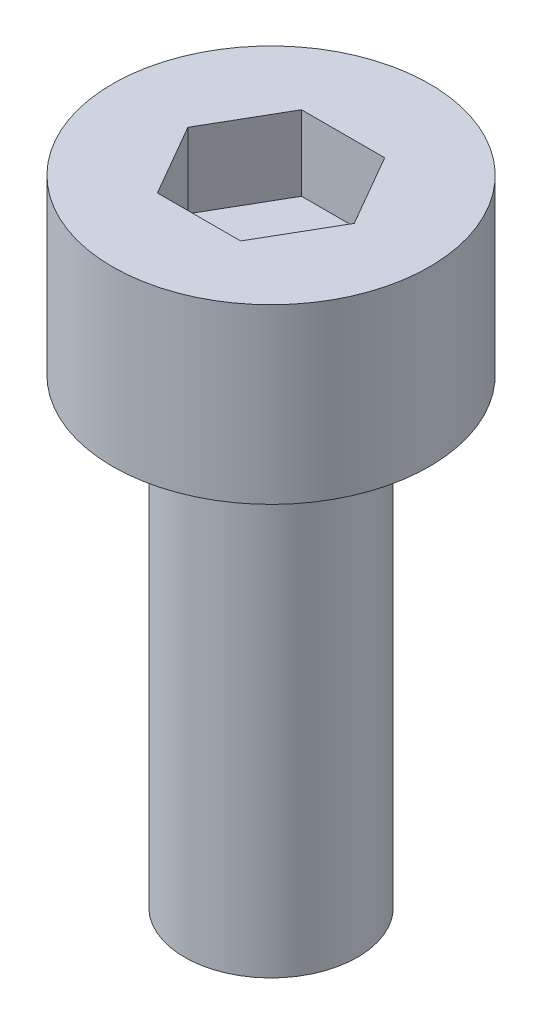
ISO-10303-21;
HEADER;
FILE_DESCRIPTION(('STEP AP214'),'2;1');
FILE_NAME('part.step','',(''),(''),'','','');
FILE_SCHEMA(('AUTOMOTIVE_DESIGN { 1 0 10303 214 1 1 1 1 }'));
ENDSEC;
DATA;
#1=APPLICATION_CONTEXT('core data for automotive mechanical design processes');
#2=APPLICATION_PROTOCOL_DEFINITION('international standard','automotive_design',2000,#1);
#3=PRODUCT_CONTEXT('',#1,'mechanical');
#4=PRODUCT('Part','Part','',(#3));
#5=PRODUCT_RELATED_PRODUCT_CATEGORY('part','',(#4));
#6=PRODUCT_DEFINITION_FORMATION('','',#4);
#7=PRODUCT_DEFINITION_CONTEXT('part definition',#1,'design');
#8=PRODUCT_DEFINITION('design','',#6,#7);
#9=PRODUCT_DEFINITION_SHAPE('','',#8);
#10=(LENGTH_UNIT() NAMED_UNIT(*) SI_UNIT(.MILLI.,.METRE.));
#11=(NAMED_UNIT(*) PLANE_ANGLE_UNIT() SI_UNIT($,.RADIAN.));
#12=(NAMED_UNIT(*) SI_UNIT($,.STERADIAN.) SOLID_ANGLE_UNIT());
#13=UNCERTAINTY_MEASURE_WITH_UNIT(LENGTH_MEASURE(1.E-05),#10,'distance_accuracy_value','');
#14=(GEOMETRIC_REPRESENTATION_CONTEXT(3) GLOBAL_UNCERTAINTY_ASSIGNED_CONTEXT((#13)) GLOBAL_UNIT_ASSIGNED_CONTEXT((#10,
#11,#12)) REPRESENTATION_CONTEXT('',''));
#15=CARTESIAN_POINT('',(0.,0.,0.));
#16=DIRECTION('',(0.,0.,1.));
#17=DIRECTION('',(1.,0.,0.));
#18=AXIS2_PLACEMENT_3D('',#15,#16,#17);
#19=CARTESIAN_POINT('',(0.,3.,0.));
#20=DIRECTION('',(0.,-1.,0.));
#21=DIRECTION('',(0.,0.,-1.));
#22=AXIS2_PLACEMENT_3D('',#19,#20,#21);
#23=CYLINDRICAL_SURFACE('',#22,2.75);
#24=CARTESIAN_POINT('',(0.,3.,0.));
#25=DIRECTION('',(0.,1.,0.));
#26=DIRECTION('',(0.,0.,1.));
#27=AXIS2_PLACEMENT_3D('',#24,#25,#26);
#28=CIRCLE('',#27,2.75);
#29=CARTESIAN_POINT('',(0.,3.,2.75));
#30=VERTEX_POINT('',#29);
#31=EDGE_CURVE('E44',#30,#30,#28,.T.);
#32=ORIENTED_EDGE('',*,*,#31,.F.);
#33=EDGE_LOOP('',(#32));
#34=FACE_BOUND('',#33,.T.);
#35=CARTESIAN_POINT('',(0.,0.,0.));
#36=DIRECTION('',(0.,1.,0.));
#37=DIRECTION('',(0.,0.,1.));
#38=AXIS2_PLACEMENT_3D('',#35,#36,#37);
#39=CIRCLE('',#38,2.75);
#40=CARTESIAN_POINT('',(0.,0.,2.75));
#41=VERTEX_POINT('',#40);
#42=EDGE_CURVE('E39',#41,#41,#39,.T.);
#43=ORIENTED_EDGE('',*,*,#42,.T.);
#44=EDGE_LOOP('',(#43));
#45=FACE_BOUND('',#44,.T.);
#46=ADVANCED_FACE('F36',(#34,#45),#23,.T.);
#47=CARTESIAN_POINT('',(0.,3.,0.));
#48=DIRECTION('',(0.,1.,0.));
#49=DIRECTION('',(0.,0.,1.));
#50=AXIS2_PLACEMENT_3D('',#47,#48,#49);
#51=PLANE('',#50);
#52=DIRECTION('',(0.5,0.,-0.866025403784439));
#53=VECTOR('',#52,1.);
#54=CARTESIAN_POINT('',(0.721687836487032,3.,1.25));
#55=LINE('',#54,#53);
#56=CARTESIAN_POINT('',(0.721687836487032,3.,1.25));
#57=VERTEX_POINT('',#56);
#58=CARTESIAN_POINT('',(1.44337567297406,3.,0.));
#59=VERTEX_POINT('',#58);
#60=EDGE_CURVE('E52',#57,#59,#55,.T.);
#61=ORIENTED_EDGE('',*,*,#60,.F.);
#62=DIRECTION('',(1.,0.,0.));
#63=VECTOR('',#62,1.);
#64=CARTESIAN_POINT('',(-0.721687836487033,3.,1.25));
#65=LINE('',#64,#63);
#66=CARTESIAN_POINT('',(-0.721687836487033,3.,1.25));
#67=VERTEX_POINT('',#66);
#68=EDGE_CURVE('E136',#67,#57,#65,.T.);
#69=ORIENTED_EDGE('',*,*,#68,.F.);
#70=DIRECTION('',(0.5,0.,0.866025403784439));
#71=VECTOR('',#70,1.);
#72=CARTESIAN_POINT('',(-1.44337567297407,3.,0.));
#73=LINE('',#72,#71);
#74=CARTESIAN_POINT('',(-1.44337567297407,3.,0.));
#75=VERTEX_POINT('',#74);
#76=EDGE_CURVE('E134',#75,#67,#73,.T.);
#77=ORIENTED_EDGE('',*,*,#76,.F.);
#78=DIRECTION('',(-0.5,0.,0.866025403784438));
#79=VECTOR('',#78,1.);
#80=CARTESIAN_POINT('',(-0.721687836487033,3.,-1.25));
#81=LINE('',#80,#79);
#82=CARTESIAN_POINT('',(-0.721687836487033,3.,-1.25));
#83=VERTEX_POINT('',#82);
#84=EDGE_CURVE('E100',#83,#75,#81,.T.);
#85=ORIENTED_EDGE('',*,*,#84,.F.);
#86=DIRECTION('',(-1.,0.,0.));
#87=VECTOR('',#86,1.);
#88=CARTESIAN_POINT('',(0.721687836487032,3.,-1.25));
#89=LINE('',#88,#87);
#90=CARTESIAN_POINT('',(0.721687836487032,3.,-1.25));
#91=VERTEX_POINT('',#90);
#92=EDGE_CURVE('E130',#91,#83,#89,.T.);
#93=ORIENTED_EDGE('',*,*,#92,.F.);
#94=DIRECTION('',(-0.5,0.,-0.866025403784439));
#95=VECTOR('',#94,1.);
#96=CARTESIAN_POINT('',(1.44337567297406,3.,0.));
#97=LINE('',#96,#95);
#98=EDGE_CURVE('E126',#59,#91,#97,.T.);
#99=ORIENTED_EDGE('',*,*,#98,.F.);
#100=EDGE_LOOP('',(#61,#69,#77,#85,#93,#99));
#101=FACE_BOUND('',#100,.T.);
#102=ORIENTED_EDGE('',*,*,#31,.T.);
#103=EDGE_LOOP('',(#102));
#104=FACE_BOUND('',#103,.T.);
#105=ADVANCED_FACE('F154',(#101,#104),#51,.T.);
#106=CARTESIAN_POINT('',(0.,0.,0.));
#107=DIRECTION('',(0.,1.,0.));
#108=DIRECTION('',(0.,0.,1.));
#109=AXIS2_PLACEMENT_3D('',#106,#107,#108);
#110=PLANE('',#109);
#111=CARTESIAN_POINT('',(0.,0.,0.));
#112=DIRECTION('',(0.,-1.,0.));
#113=DIRECTION('',(0.,0.,-1.));
#114=AXIS2_PLACEMENT_3D('',#111,#112,#113);
#115=CIRCLE('',#114,1.5);
#116=CARTESIAN_POINT('',(0.,0.,-1.5));
#117=VERTEX_POINT('',#116);
#118=EDGE_CURVE('E11',#117,#117,#115,.T.);
#119=ORIENTED_EDGE('',*,*,#118,.F.);
#120=EDGE_LOOP('',(#119));
#121=FACE_BOUND('',#120,.T.);
#122=ORIENTED_EDGE('',*,*,#42,.F.);
#123=EDGE_LOOP('',(#122));
#124=FACE_BOUND('',#123,.T.);
#125=ADVANCED_FACE('F151',(#121,#124),#110,.F.);
#126=CARTESIAN_POINT('',(0.721687836487032,1.7,1.25));
#127=DIRECTION('',(0.866025403784439,0.,0.5));
#128=DIRECTION('',(0.5,0.,-0.866025403784439));
#129=AXIS2_PLACEMENT_3D('',#126,#127,#128);
#130=PLANE('',#129);
#131=ORIENTED_EDGE('',*,*,#60,.T.);
#132=DIRECTION('',(0.,1.,0.));
#133=VECTOR('',#132,1.);
#134=CARTESIAN_POINT('',(1.44337567297406,1.7,0.));
#135=LINE('',#134,#133);
#136=CARTESIAN_POINT('',(1.44337567297406,1.7,0.));
#137=VERTEX_POINT('',#136);
#138=EDGE_CURVE('E82',#137,#59,#135,.T.);
#139=ORIENTED_EDGE('',*,*,#138,.F.);
#140=DIRECTION('',(0.5,0.,-0.866025403784439));
#141=VECTOR('',#140,1.);
#142=CARTESIAN_POINT('',(0.721687836487032,1.7,1.25));
#143=LINE('',#142,#141);
#144=CARTESIAN_POINT('',(0.721687836487032,1.7,1.25));
#145=VERTEX_POINT('',#144);
#146=EDGE_CURVE('E138',#145,#137,#143,.T.);
#147=ORIENTED_EDGE('',*,*,#146,.F.);
#148=DIRECTION('',(0.,1.,0.));
#149=VECTOR('',#148,1.);
#150=CARTESIAN_POINT('',(0.721687836487032,1.7,1.25));
#151=LINE('',#150,#149);
#152=EDGE_CURVE('E60',#145,#57,#151,.T.);
#153=ORIENTED_EDGE('',*,*,#152,.T.);
#154=EDGE_LOOP('',(#131,#139,#147,#153));
#155=FACE_BOUND('',#154,.T.);
#156=ADVANCED_FACE('F153',(#155),#130,.F.);
#157=CARTESIAN_POINT('',(-0.721687836487033,1.7,1.25));
#158=DIRECTION('',(0.,0.,1.));
#159=DIRECTION('',(1.,0.,0.));
#160=AXIS2_PLACEMENT_3D('',#157,#158,#159);
#161=PLANE('',#160);
#162=ORIENTED_EDGE('',*,*,#68,.T.);
#163=ORIENTED_EDGE('',*,*,#152,.F.);
#164=DIRECTION('',(1.,0.,0.));
#165=VECTOR('',#164,1.);
#166=CARTESIAN_POINT('',(-0.721687836487033,1.7,1.25));
#167=LINE('',#166,#165);
#168=CARTESIAN_POINT('',(-0.721687836487033,1.7,1.25));
#169=VERTEX_POINT('',#168);
#170=EDGE_CURVE('E112',#169,#145,#167,.T.);
#171=ORIENTED_EDGE('',*,*,#170,.F.);
#172=DIRECTION('',(0.,1.,0.));
#173=VECTOR('',#172,1.);
#174=CARTESIAN_POINT('',(-0.721687836487033,1.7,1.25));
#175=LINE('',#174,#173);
#176=EDGE_CURVE('E104',#169,#67,#175,.T.);
#177=ORIENTED_EDGE('',*,*,#176,.T.);
#178=EDGE_LOOP('',(#162,#163,#171,#177));
#179=FACE_BOUND('',#178,.T.);
#180=ADVANCED_FACE('F160',(#179),#161,.F.);
#181=CARTESIAN_POINT('',(-1.44337567297407,1.7,0.));
#182=DIRECTION('',(-0.866025403784439,0.,0.5));
#183=DIRECTION('',(0.5,0.,0.866025403784439));
#184=AXIS2_PLACEMENT_3D('',#181,#182,#183);
#185=PLANE('',#184);
#186=ORIENTED_EDGE('',*,*,#76,.T.);
#187=ORIENTED_EDGE('',*,*,#176,.F.);
#188=DIRECTION('',(0.5,0.,0.866025403784439));
#189=VECTOR('',#188,1.);
#190=CARTESIAN_POINT('',(-1.44337567297407,1.7,0.));
#191=LINE('',#190,#189);
#192=CARTESIAN_POINT('',(-1.44337567297407,1.7,0.));
#193=VERTEX_POINT('',#192);
#194=EDGE_CURVE('E108',#193,#169,#191,.T.);
#195=ORIENTED_EDGE('',*,*,#194,.F.);
#196=DIRECTION('',(0.,1.,0.));
#197=VECTOR('',#196,1.);
#198=CARTESIAN_POINT('',(-1.44337567297407,1.7,0.));
#199=LINE('',#198,#197);
#200=EDGE_CURVE('E93',#193,#75,#199,.T.);
#201=ORIENTED_EDGE('',*,*,#200,.T.);
#202=EDGE_LOOP('',(#186,#187,#195,#201));
#203=FACE_BOUND('',#202,.T.);
#204=ADVANCED_FACE('F109',(#203),#185,.F.);
#205=CARTESIAN_POINT('',(-0.721687836487033,1.7,-1.25));
#206=DIRECTION('',(-0.866025403784439,0.,-0.5));
#207=DIRECTION('',(-0.5,0.,0.866025403784439));
#208=AXIS2_PLACEMENT_3D('',#205,#206,#207);
#209=PLANE('',#208);
#210=ORIENTED_EDGE('',*,*,#84,.T.);
#211=ORIENTED_EDGE('',*,*,#200,.F.);
#212=DIRECTION('',(-0.5,0.,0.866025403784438));
#213=VECTOR('',#212,1.);
#214=CARTESIAN_POINT('',(-0.721687836487033,1.7,-1.25));
#215=LINE('',#214,#213);
#216=CARTESIAN_POINT('',(-0.721687836487033,1.7,-1.25));
#217=VERTEX_POINT('',#216);
#218=EDGE_CURVE('E97',#217,#193,#215,.T.);
#219=ORIENTED_EDGE('',*,*,#218,.F.);
#220=DIRECTION('',(0.,1.,0.));
#221=VECTOR('',#220,1.);
#222=CARTESIAN_POINT('',(-0.721687836487033,1.7,-1.25));
#223=LINE('',#222,#221);
#224=EDGE_CURVE('E105',#217,#83,#223,.T.);
#225=ORIENTED_EDGE('',*,*,#224,.T.);
#226=EDGE_LOOP('',(#210,#211,#219,#225));
#227=FACE_BOUND('',#226,.T.);
#228=ADVANCED_FACE('F95',(#227),#209,.F.);
#229=CARTESIAN_POINT('',(0.721687836487032,1.7,-1.25));
#230=DIRECTION('',(0.,0.,-1.));
#231=DIRECTION('',(-1.,0.,0.));
#232=AXIS2_PLACEMENT_3D('',#229,#230,#231);
#233=PLANE('',#232);
#234=ORIENTED_EDGE('',*,*,#92,.T.);
#235=ORIENTED_EDGE('',*,*,#224,.F.);
#236=DIRECTION('',(-1.,0.,0.));
#237=VECTOR('',#236,1.);
#238=CARTESIAN_POINT('',(0.721687836487032,1.7,-1.25));
#239=LINE('',#238,#237);
#240=CARTESIAN_POINT('',(0.721687836487032,1.7,-1.25));
#241=VERTEX_POINT('',#240);
#242=EDGE_CURVE('E118',#241,#217,#239,.T.);
#243=ORIENTED_EDGE('',*,*,#242,.F.);
#244=DIRECTION('',(0.,1.,0.));
#245=VECTOR('',#244,1.);
#246=CARTESIAN_POINT('',(0.721687836487032,1.7,-1.25));
#247=LINE('',#246,#245);
#248=EDGE_CURVE('E142',#241,#91,#247,.T.);
#249=ORIENTED_EDGE('',*,*,#248,.T.);
#250=EDGE_LOOP('',(#234,#235,#243,#249));
#251=FACE_BOUND('',#250,.T.);
#252=ADVANCED_FACE('F205',(#251),#233,.F.);
#253=CARTESIAN_POINT('',(1.44337567297406,1.7,0.));
#254=DIRECTION('',(0.866025403784439,0.,-0.5));
#255=DIRECTION('',(-0.5,0.,-0.866025403784439));
#256=AXIS2_PLACEMENT_3D('',#253,#254,#255);
#257=PLANE('',#256);
#258=ORIENTED_EDGE('',*,*,#98,.T.);
#259=ORIENTED_EDGE('',*,*,#248,.F.);
#260=DIRECTION('',(-0.5,0.,-0.866025403784439));
#261=VECTOR('',#260,1.);
#262=CARTESIAN_POINT('',(1.44337567297406,1.7,0.));
#263=LINE('',#262,#261);
#264=EDGE_CURVE('E120',#137,#241,#263,.T.);
#265=ORIENTED_EDGE('',*,*,#264,.F.);
#266=ORIENTED_EDGE('',*,*,#138,.T.);
#267=EDGE_LOOP('',(#258,#259,#265,#266));
#268=FACE_BOUND('',#267,.T.);
#269=ADVANCED_FACE('F214',(#268),#257,.F.);
#270=CARTESIAN_POINT('',(0.,1.7,0.));
#271=DIRECTION('',(0.,1.,0.));
#272=DIRECTION('',(0.,0.,1.));
#273=AXIS2_PLACEMENT_3D('',#270,#271,#272);
#274=PLANE('',#273);
#275=ORIENTED_EDGE('',*,*,#146,.T.);
#276=ORIENTED_EDGE('',*,*,#264,.T.);
#277=ORIENTED_EDGE('',*,*,#242,.T.);
#278=ORIENTED_EDGE('',*,*,#218,.T.);
#279=ORIENTED_EDGE('',*,*,#194,.T.);
#280=ORIENTED_EDGE('',*,*,#170,.T.);
#281=EDGE_LOOP('',(#275,#276,#277,#278,#279,#280));
#282=FACE_BOUND('',#281,.T.);
#283=ADVANCED_FACE('F115',(#282),#274,.T.);
#284=CARTESIAN_POINT('',(0.,-8.,0.));
#285=DIRECTION('',(0.,1.,0.));
#286=DIRECTION('',(0.,0.,1.));
#287=AXIS2_PLACEMENT_3D('',#284,#285,#286);
#288=CYLINDRICAL_SURFACE('',#287,1.5);
#289=CARTESIAN_POINT('',(0.,-8.,0.));
#290=DIRECTION('',(0.,-1.,0.));
#291=DIRECTION('',(0.,0.,-1.));
#292=AXIS2_PLACEMENT_3D('',#289,#290,#291);
#293=CIRCLE('',#292,1.5);
#294=CARTESIAN_POINT('',(0.,-8.,-1.5));
#295=VERTEX_POINT('',#294);
#296=EDGE_CURVE('E127',#295,#295,#293,.T.);
#297=ORIENTED_EDGE('',*,*,#296,.F.);
#298=EDGE_LOOP('',(#297));
#299=FACE_BOUND('',#298,.T.);
#300=ORIENTED_EDGE('',*,*,#118,.T.);
#301=EDGE_LOOP('',(#300));
#302=FACE_BOUND('',#301,.T.);
#303=ADVANCED_FACE('F232',(#299,#302),#288,.T.);
#304=CARTESIAN_POINT('',(0.,-8.,0.));
#305=DIRECTION('',(0.,-1.,0.));
#306=DIRECTION('',(0.,0.,-1.));
#307=AXIS2_PLACEMENT_3D('',#304,#305,#306);
#308=PLANE('',#307);
#309=ORIENTED_EDGE('',*,*,#296,.T.);
#310=EDGE_LOOP('',(#309));
#311=FACE_BOUND('',#310,.T.);
#312=ADVANCED_FACE('F246',(#311),#308,.T.);
#313=CLOSED_SHELL('',(#46,#105,#125,#156,#180,#204,#228,#252,#269,#283,#303,#312));
#314=MANIFOLD_SOLID_BREP('B2',#313);
#315=ADVANCED_BREP_SHAPE_REPRESENTATION('',(#18,#314),#14);
#316=SHAPE_DEFINITION_REPRESENTATION(#9,#315);
ENDSEC;
END-ISO-10303-21;
